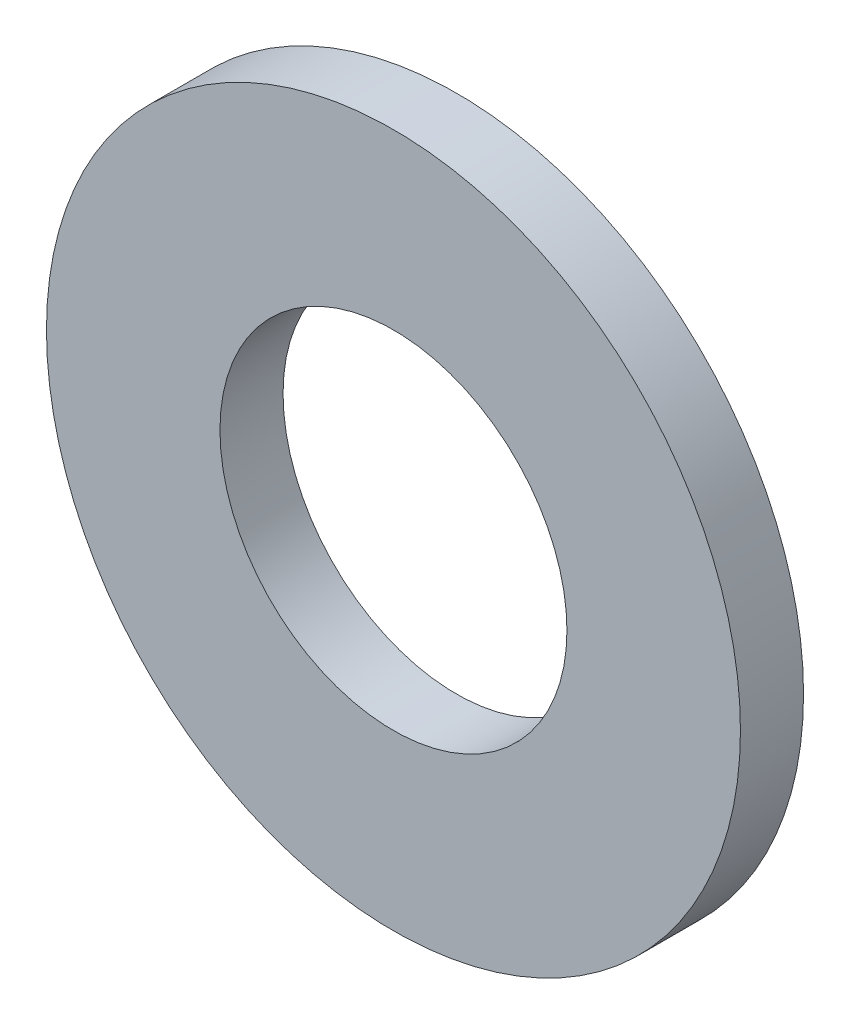
ISO-10303-21;
HEADER;
FILE_DESCRIPTION(('STEP AP214'),'2;1');
FILE_NAME('part.step','',(''),(''),'','','');
FILE_SCHEMA(('AUTOMOTIVE_DESIGN { 1 0 10303 214 1 1 1 1 }'));
ENDSEC;
DATA;
#1=APPLICATION_CONTEXT('core data for automotive mechanical design processes');
#2=APPLICATION_PROTOCOL_DEFINITION('international standard','automotive_design',2000,#1);
#3=PRODUCT_CONTEXT('',#1,'mechanical');
#4=PRODUCT('Part','Part','',(#3));
#5=PRODUCT_RELATED_PRODUCT_CATEGORY('part','',(#4));
#6=PRODUCT_DEFINITION_FORMATION('','',#4);
#7=PRODUCT_DEFINITION_CONTEXT('part definition',#1,'design');
#8=PRODUCT_DEFINITION('design','',#6,#7);
#9=PRODUCT_DEFINITION_SHAPE('','',#8);
#10=(LENGTH_UNIT() NAMED_UNIT(*) SI_UNIT(.MILLI.,.METRE.));
#11=(NAMED_UNIT(*) PLANE_ANGLE_UNIT() SI_UNIT($,.RADIAN.));
#12=(NAMED_UNIT(*) SI_UNIT($,.STERADIAN.) SOLID_ANGLE_UNIT());
#13=UNCERTAINTY_MEASURE_WITH_UNIT(LENGTH_MEASURE(1.E-05),#10,'distance_accuracy_value','');
#14=(GEOMETRIC_REPRESENTATION_CONTEXT(3) GLOBAL_UNCERTAINTY_ASSIGNED_CONTEXT((#13)) GLOBAL_UNIT_ASSIGNED_CONTEXT((#10,
#11,#12)) REPRESENTATION_CONTEXT('',''));
#15=CARTESIAN_POINT('',(0.,0.,0.));
#16=DIRECTION('',(0.,0.,1.));
#17=DIRECTION('',(1.,0.,0.));
#18=AXIS2_PLACEMENT_3D('',#15,#16,#17);
#19=CARTESIAN_POINT('',(0.,0.,1.));
#20=DIRECTION('',(0.,0.,1.));
#21=DIRECTION('',(1.,0.,0.));
#22=AXIS2_PLACEMENT_3D('',#19,#20,#21);
#23=PLANE('',#22);
#24=CARTESIAN_POINT('',(0.,0.,1.));
#25=DIRECTION('',(0.,0.,1.));
#26=DIRECTION('',(1.,0.,0.));
#27=AXIS2_PLACEMENT_3D('',#24,#25,#26);
#28=CIRCLE('',#27,5.5);
#29=CARTESIAN_POINT('',(5.5,0.,1.));
#30=VERTEX_POINT('',#29);
#31=EDGE_CURVE('E10',#30,#30,#28,.T.);
#32=ORIENTED_EDGE('',*,*,#31,.T.);
#33=EDGE_LOOP('',(#32));
#34=FACE_BOUND('',#33,.T.);
#35=CARTESIAN_POINT('',(0.,0.,1.));
#36=DIRECTION('',(0.,0.,1.));
#37=DIRECTION('',(1.,0.,0.));
#38=AXIS2_PLACEMENT_3D('',#35,#36,#37);
#39=CIRCLE('',#38,2.75);
#40=CARTESIAN_POINT('',(2.75,0.,1.));
#41=VERTEX_POINT('',#40);
#42=EDGE_CURVE('E39',#41,#41,#39,.T.);
#43=ORIENTED_EDGE('',*,*,#42,.F.);
#44=EDGE_LOOP('',(#43));
#45=FACE_BOUND('',#44,.T.);
#46=ADVANCED_FACE('F28',(#34,#45),#23,.T.);
#47=CARTESIAN_POINT('',(0.,0.,0.));
#48=DIRECTION('',(0.,0.,1.));
#49=DIRECTION('',(1.,0.,0.));
#50=AXIS2_PLACEMENT_3D('',#47,#48,#49);
#51=PLANE('',#50);
#52=CARTESIAN_POINT('',(0.,0.,0.));
#53=DIRECTION('',(0.,0.,1.));
#54=DIRECTION('',(1.,0.,0.));
#55=AXIS2_PLACEMENT_3D('',#52,#53,#54);
#56=CIRCLE('',#55,5.5);
#57=CARTESIAN_POINT('',(5.5,0.,0.));
#58=VERTEX_POINT('',#57);
#59=EDGE_CURVE('E32',#58,#58,#56,.T.);
#60=ORIENTED_EDGE('',*,*,#59,.F.);
#61=EDGE_LOOP('',(#60));
#62=FACE_BOUND('',#61,.T.);
#63=CARTESIAN_POINT('',(0.,0.,0.));
#64=DIRECTION('',(0.,0.,1.));
#65=DIRECTION('',(1.,0.,0.));
#66=AXIS2_PLACEMENT_3D('',#63,#64,#65);
#67=CIRCLE('',#66,2.75);
#68=CARTESIAN_POINT('',(2.75,0.,0.));
#69=VERTEX_POINT('',#68);
#70=EDGE_CURVE('E41',#69,#69,#67,.T.);
#71=ORIENTED_EDGE('',*,*,#70,.T.);
#72=EDGE_LOOP('',(#71));
#73=FACE_BOUND('',#72,.T.);
#74=ADVANCED_FACE('F51',(#62,#73),#51,.F.);
#75=CARTESIAN_POINT('',(0.,0.,1.));
#76=DIRECTION('',(0.,0.,-1.));
#77=DIRECTION('',(-1.,0.,0.));
#78=AXIS2_PLACEMENT_3D('',#75,#76,#77);
#79=CYLINDRICAL_SURFACE('',#78,5.5);
#80=ORIENTED_EDGE('',*,*,#31,.F.);
#81=EDGE_LOOP('',(#80));
#82=FACE_BOUND('',#81,.T.);
#83=ORIENTED_EDGE('',*,*,#59,.T.);
#84=EDGE_LOOP('',(#83));
#85=FACE_BOUND('',#84,.T.);
#86=ADVANCED_FACE('F30',(#82,#85),#79,.T.);
#87=CARTESIAN_POINT('',(0.,0.,1.));
#88=DIRECTION('',(0.,0.,-1.));
#89=DIRECTION('',(-1.,0.,0.));
#90=AXIS2_PLACEMENT_3D('',#87,#88,#89);
#91=CYLINDRICAL_SURFACE('',#90,2.75);
#92=ORIENTED_EDGE('',*,*,#42,.T.);
#93=EDGE_LOOP('',(#92));
#94=FACE_BOUND('',#93,.T.);
#95=ORIENTED_EDGE('',*,*,#70,.F.);
#96=EDGE_LOOP('',(#95));
#97=FACE_BOUND('',#96,.T.);
#98=ADVANCED_FACE('F47',(#94,#97),#91,.F.);
#99=CLOSED_SHELL('',(#46,#74,#86,#98));
#100=MANIFOLD_SOLID_BREP('B2',#99);
#101=ADVANCED_BREP_SHAPE_REPRESENTATION('',(#18,#100),#14);
#102=SHAPE_DEFINITION_REPRESENTATION(#9,#101);
ENDSEC;
END-ISO-10303-21;
